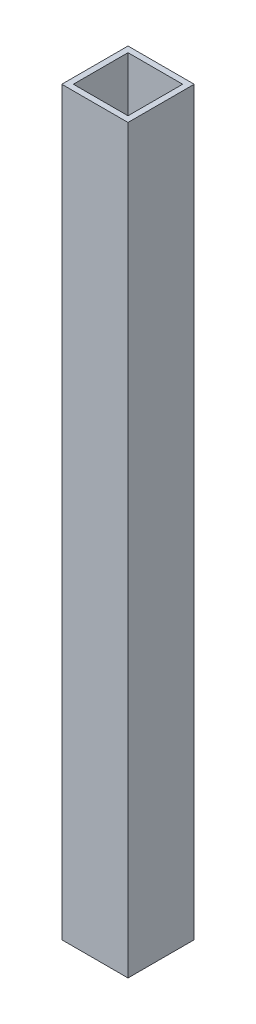
ISO-10303-21;
HEADER;
FILE_DESCRIPTION(('STEP AP214'),'2;1');
FILE_NAME('part.step','',(''),(''),'','','');
FILE_SCHEMA(('AUTOMOTIVE_DESIGN { 1 0 10303 214 1 1 1 1 }'));
ENDSEC;
DATA;
#1=APPLICATION_CONTEXT('core data for automotive mechanical design processes');
#2=APPLICATION_PROTOCOL_DEFINITION('international standard','automotive_design',2000,#1);
#3=PRODUCT_CONTEXT('',#1,'mechanical');
#4=PRODUCT('Part','Part','',(#3));
#5=PRODUCT_RELATED_PRODUCT_CATEGORY('part','',(#4));
#6=PRODUCT_DEFINITION_FORMATION('','',#4);
#7=PRODUCT_DEFINITION_CONTEXT('part definition',#1,'design');
#8=PRODUCT_DEFINITION('design','',#6,#7);
#9=PRODUCT_DEFINITION_SHAPE('','',#8);
#10=(LENGTH_UNIT() NAMED_UNIT(*) SI_UNIT(.MILLI.,.METRE.));
#11=(NAMED_UNIT(*) PLANE_ANGLE_UNIT() SI_UNIT($,.RADIAN.));
#12=(NAMED_UNIT(*) SI_UNIT($,.STERADIAN.) SOLID_ANGLE_UNIT());
#13=UNCERTAINTY_MEASURE_WITH_UNIT(LENGTH_MEASURE(1.E-05),#10,'distance_accuracy_value','');
#14=(GEOMETRIC_REPRESENTATION_CONTEXT(3) GLOBAL_UNCERTAINTY_ASSIGNED_CONTEXT((#13)) GLOBAL_UNIT_ASSIGNED_CONTEXT((#10,
#11,#12)) REPRESENTATION_CONTEXT('',''));
#15=CARTESIAN_POINT('',(0.,0.,0.));
#16=DIRECTION('',(0.,0.,1.));
#17=DIRECTION('',(1.,0.,0.));
#18=AXIS2_PLACEMENT_3D('',#15,#16,#17);
#19=CARTESIAN_POINT('',(0.,211.5,0.));
#20=DIRECTION('',(0.,-1.,0.));
#21=DIRECTION('',(0.,0.,-1.));
#22=AXIS2_PLACEMENT_3D('',#19,#20,#21);
#23=PLANE('',#22);
#24=DIRECTION('',(0.,0.,1.));
#25=VECTOR('',#24,1.);
#26=CARTESIAN_POINT('',(-9.45,211.5,9.45));
#27=LINE('',#26,#25);
#28=CARTESIAN_POINT('',(-9.45,211.5,-9.45));
#29=VERTEX_POINT('',#28);
#30=CARTESIAN_POINT('',(-9.45,211.5,9.45));
#31=VERTEX_POINT('',#30);
#32=EDGE_CURVE('E134',#29,#31,#27,.T.);
#33=ORIENTED_EDGE('',*,*,#32,.T.);
#34=DIRECTION('',(1.,0.,0.));
#35=VECTOR('',#34,1.);
#36=CARTESIAN_POINT('',(-9.45,211.5,9.45));
#37=LINE('',#36,#35);
#38=CARTESIAN_POINT('',(9.45,211.5,9.45));
#39=VERTEX_POINT('',#38);
#40=EDGE_CURVE('E137',#31,#39,#37,.T.);
#41=ORIENTED_EDGE('',*,*,#40,.T.);
#42=DIRECTION('',(0.,0.,-1.));
#43=VECTOR('',#42,1.);
#44=CARTESIAN_POINT('',(9.45,211.5,9.45));
#45=LINE('',#44,#43);
#46=CARTESIAN_POINT('',(9.45,211.5,-9.45));
#47=VERTEX_POINT('',#46);
#48=EDGE_CURVE('E140',#39,#47,#45,.T.);
#49=ORIENTED_EDGE('',*,*,#48,.T.);
#50=DIRECTION('',(-1.,0.,0.));
#51=VECTOR('',#50,1.);
#52=CARTESIAN_POINT('',(-9.45,211.5,-9.45));
#53=LINE('',#52,#51);
#54=EDGE_CURVE('E142',#47,#29,#53,.T.);
#55=ORIENTED_EDGE('',*,*,#54,.T.);
#56=EDGE_LOOP('',(#33,#41,#49,#55));
#57=FACE_BOUND('',#56,.T.);
#58=DIRECTION('',(0.,0.,-1.));
#59=VECTOR('',#58,1.);
#60=CARTESIAN_POINT('',(7.8,211.5,7.8));
#61=LINE('',#60,#59);
#62=CARTESIAN_POINT('',(7.8,211.5,7.8));
#63=VERTEX_POINT('',#62);
#64=CARTESIAN_POINT('',(7.8,211.5,-7.8));
#65=VERTEX_POINT('',#64);
#66=EDGE_CURVE('E98',#63,#65,#61,.T.);
#67=ORIENTED_EDGE('',*,*,#66,.F.);
#68=DIRECTION('',(1.,0.,0.));
#69=VECTOR('',#68,1.);
#70=CARTESIAN_POINT('',(-7.8,211.5,7.8));
#71=LINE('',#70,#69);
#72=CARTESIAN_POINT('',(-7.8,211.5,7.8));
#73=VERTEX_POINT('',#72);
#74=EDGE_CURVE('E120',#73,#63,#71,.T.);
#75=ORIENTED_EDGE('',*,*,#74,.F.);
#76=DIRECTION('',(0.,0.,1.));
#77=VECTOR('',#76,1.);
#78=CARTESIAN_POINT('',(-7.8,211.5,7.8));
#79=LINE('',#78,#77);
#80=CARTESIAN_POINT('',(-7.8,211.5,-7.8));
#81=VERTEX_POINT('',#80);
#82=EDGE_CURVE('E118',#81,#73,#79,.T.);
#83=ORIENTED_EDGE('',*,*,#82,.F.);
#84=DIRECTION('',(-1.,0.,0.));
#85=VECTOR('',#84,1.);
#86=CARTESIAN_POINT('',(-7.8,211.5,-7.8));
#87=LINE('',#86,#85);
#88=EDGE_CURVE('E106',#65,#81,#87,.T.);
#89=ORIENTED_EDGE('',*,*,#88,.F.);
#90=EDGE_LOOP('',(#67,#75,#83,#89));
#91=FACE_BOUND('',#90,.T.);
#92=ADVANCED_FACE('F33',(#57,#91),#23,.F.);
#93=CARTESIAN_POINT('',(0.,0.,0.));
#94=DIRECTION('',(0.,-1.,0.));
#95=DIRECTION('',(0.,0.,-1.));
#96=AXIS2_PLACEMENT_3D('',#93,#94,#95);
#97=PLANE('',#96);
#98=DIRECTION('',(0.,0.,1.));
#99=VECTOR('',#98,1.);
#100=CARTESIAN_POINT('',(-9.45,0.,9.45));
#101=LINE('',#100,#99);
#102=CARTESIAN_POINT('',(-9.45,0.,-9.45));
#103=VERTEX_POINT('',#102);
#104=CARTESIAN_POINT('',(-9.45,0.,9.45));
#105=VERTEX_POINT('',#104);
#106=EDGE_CURVE('E114',#103,#105,#101,.T.);
#107=ORIENTED_EDGE('',*,*,#106,.F.);
#108=DIRECTION('',(-1.,0.,0.));
#109=VECTOR('',#108,1.);
#110=CARTESIAN_POINT('',(-9.45,0.,-9.45));
#111=LINE('',#110,#109);
#112=CARTESIAN_POINT('',(9.45,0.,-9.45));
#113=VERTEX_POINT('',#112);
#114=EDGE_CURVE('E138',#113,#103,#111,.T.);
#115=ORIENTED_EDGE('',*,*,#114,.F.);
#116=DIRECTION('',(0.,0.,-1.));
#117=VECTOR('',#116,1.);
#118=CARTESIAN_POINT('',(9.45,0.,9.45));
#119=LINE('',#118,#117);
#120=CARTESIAN_POINT('',(9.45,0.,9.45));
#121=VERTEX_POINT('',#120);
#122=EDGE_CURVE('E149',#121,#113,#119,.T.);
#123=ORIENTED_EDGE('',*,*,#122,.F.);
#124=DIRECTION('',(1.,0.,0.));
#125=VECTOR('',#124,1.);
#126=CARTESIAN_POINT('',(-9.45,0.,9.45));
#127=LINE('',#126,#125);
#128=EDGE_CURVE('E147',#105,#121,#127,.T.);
#129=ORIENTED_EDGE('',*,*,#128,.F.);
#130=EDGE_LOOP('',(#107,#115,#123,#129));
#131=FACE_BOUND('',#130,.T.);
#132=DIRECTION('',(1.,0.,0.));
#133=VECTOR('',#132,1.);
#134=CARTESIAN_POINT('',(-7.8,0.,7.8));
#135=LINE('',#134,#133);
#136=CARTESIAN_POINT('',(-7.8,0.,7.8));
#137=VERTEX_POINT('',#136);
#138=CARTESIAN_POINT('',(7.8,0.,7.8));
#139=VERTEX_POINT('',#138);
#140=EDGE_CURVE('E107',#137,#139,#135,.T.);
#141=ORIENTED_EDGE('',*,*,#140,.T.);
#142=DIRECTION('',(0.,0.,-1.));
#143=VECTOR('',#142,1.);
#144=CARTESIAN_POINT('',(7.8,0.,7.8));
#145=LINE('',#144,#143);
#146=CARTESIAN_POINT('',(7.8,0.,-7.8));
#147=VERTEX_POINT('',#146);
#148=EDGE_CURVE('E56',#139,#147,#145,.T.);
#149=ORIENTED_EDGE('',*,*,#148,.T.);
#150=DIRECTION('',(-1.,0.,0.));
#151=VECTOR('',#150,1.);
#152=CARTESIAN_POINT('',(-7.8,0.,-7.8));
#153=LINE('',#152,#151);
#154=CARTESIAN_POINT('',(-7.8,0.,-7.8));
#155=VERTEX_POINT('',#154);
#156=EDGE_CURVE('E113',#147,#155,#153,.T.);
#157=ORIENTED_EDGE('',*,*,#156,.T.);
#158=DIRECTION('',(0.,0.,1.));
#159=VECTOR('',#158,1.);
#160=CARTESIAN_POINT('',(-7.8,0.,7.8));
#161=LINE('',#160,#159);
#162=EDGE_CURVE('E126',#155,#137,#161,.T.);
#163=ORIENTED_EDGE('',*,*,#162,.T.);
#164=EDGE_LOOP('',(#141,#149,#157,#163));
#165=FACE_BOUND('',#164,.T.);
#166=ADVANCED_FACE('F167',(#131,#165),#97,.T.);
#167=CARTESIAN_POINT('',(-9.45,211.5,9.45));
#168=DIRECTION('',(1.,0.,0.));
#169=DIRECTION('',(0.,0.,-1.));
#170=AXIS2_PLACEMENT_3D('',#167,#168,#169);
#171=PLANE('',#170);
#172=ORIENTED_EDGE('',*,*,#106,.T.);
#173=DIRECTION('',(0.,-1.,0.));
#174=VECTOR('',#173,1.);
#175=CARTESIAN_POINT('',(-9.45,211.5,9.45));
#176=LINE('',#175,#174);
#177=EDGE_CURVE('E11',#31,#105,#176,.T.);
#178=ORIENTED_EDGE('',*,*,#177,.F.);
#179=ORIENTED_EDGE('',*,*,#32,.F.);
#180=DIRECTION('',(0.,-1.,0.));
#181=VECTOR('',#180,1.);
#182=CARTESIAN_POINT('',(-9.45,211.5,-9.45));
#183=LINE('',#182,#181);
#184=EDGE_CURVE('E144',#29,#103,#183,.T.);
#185=ORIENTED_EDGE('',*,*,#184,.T.);
#186=EDGE_LOOP('',(#172,#178,#179,#185));
#187=FACE_BOUND('',#186,.T.);
#188=ADVANCED_FACE('F35',(#187),#171,.F.);
#189=CARTESIAN_POINT('',(-9.45,211.5,9.45));
#190=DIRECTION('',(0.,0.,-1.));
#191=DIRECTION('',(-1.,0.,0.));
#192=AXIS2_PLACEMENT_3D('',#189,#190,#191);
#193=PLANE('',#192);
#194=ORIENTED_EDGE('',*,*,#128,.T.);
#195=DIRECTION('',(0.,-1.,0.));
#196=VECTOR('',#195,1.);
#197=CARTESIAN_POINT('',(9.45,211.5,9.45));
#198=LINE('',#197,#196);
#199=EDGE_CURVE('E41',#39,#121,#198,.T.);
#200=ORIENTED_EDGE('',*,*,#199,.F.);
#201=ORIENTED_EDGE('',*,*,#40,.F.);
#202=ORIENTED_EDGE('',*,*,#177,.T.);
#203=EDGE_LOOP('',(#194,#200,#201,#202));
#204=FACE_BOUND('',#203,.T.);
#205=ADVANCED_FACE('F177',(#204),#193,.F.);
#206=CARTESIAN_POINT('',(9.45,211.5,9.45));
#207=DIRECTION('',(-1.,0.,0.));
#208=DIRECTION('',(0.,0.,1.));
#209=AXIS2_PLACEMENT_3D('',#206,#207,#208);
#210=PLANE('',#209);
#211=ORIENTED_EDGE('',*,*,#122,.T.);
#212=DIRECTION('',(0.,-1.,0.));
#213=VECTOR('',#212,1.);
#214=CARTESIAN_POINT('',(9.45,211.5,-9.45));
#215=LINE('',#214,#213);
#216=EDGE_CURVE('E154',#47,#113,#215,.T.);
#217=ORIENTED_EDGE('',*,*,#216,.F.);
#218=ORIENTED_EDGE('',*,*,#48,.F.);
#219=ORIENTED_EDGE('',*,*,#199,.T.);
#220=EDGE_LOOP('',(#211,#217,#218,#219));
#221=FACE_BOUND('',#220,.T.);
#222=ADVANCED_FACE('F161',(#221),#210,.F.);
#223=CARTESIAN_POINT('',(-9.45,211.5,-9.45));
#224=DIRECTION('',(0.,0.,1.));
#225=DIRECTION('',(1.,0.,0.));
#226=AXIS2_PLACEMENT_3D('',#223,#224,#225);
#227=PLANE('',#226);
#228=ORIENTED_EDGE('',*,*,#114,.T.);
#229=ORIENTED_EDGE('',*,*,#184,.F.);
#230=ORIENTED_EDGE('',*,*,#54,.F.);
#231=ORIENTED_EDGE('',*,*,#216,.T.);
#232=EDGE_LOOP('',(#228,#229,#230,#231));
#233=FACE_BOUND('',#232,.T.);
#234=ADVANCED_FACE('F171',(#233),#227,.F.);
#235=CARTESIAN_POINT('',(7.8,211.5,7.8));
#236=DIRECTION('',(-1.,0.,0.));
#237=DIRECTION('',(0.,0.,1.));
#238=AXIS2_PLACEMENT_3D('',#235,#236,#237);
#239=PLANE('',#238);
#240=ORIENTED_EDGE('',*,*,#148,.F.);
#241=DIRECTION('',(0.,-1.,0.));
#242=VECTOR('',#241,1.);
#243=CARTESIAN_POINT('',(7.8,211.5,7.8));
#244=LINE('',#243,#242);
#245=EDGE_CURVE('E102',#63,#139,#244,.T.);
#246=ORIENTED_EDGE('',*,*,#245,.F.);
#247=ORIENTED_EDGE('',*,*,#66,.T.);
#248=DIRECTION('',(0.,-1.,0.));
#249=VECTOR('',#248,1.);
#250=CARTESIAN_POINT('',(7.8,211.5,-7.8));
#251=LINE('',#250,#249);
#252=EDGE_CURVE('E101',#65,#147,#251,.T.);
#253=ORIENTED_EDGE('',*,*,#252,.T.);
#254=EDGE_LOOP('',(#240,#246,#247,#253));
#255=FACE_BOUND('',#254,.T.);
#256=ADVANCED_FACE('F100',(#255),#239,.T.);
#257=CARTESIAN_POINT('',(-7.8,211.5,-7.8));
#258=DIRECTION('',(0.,0.,1.));
#259=DIRECTION('',(1.,0.,0.));
#260=AXIS2_PLACEMENT_3D('',#257,#258,#259);
#261=PLANE('',#260);
#262=ORIENTED_EDGE('',*,*,#156,.F.);
#263=ORIENTED_EDGE('',*,*,#252,.F.);
#264=ORIENTED_EDGE('',*,*,#88,.T.);
#265=DIRECTION('',(0.,-1.,0.));
#266=VECTOR('',#265,1.);
#267=CARTESIAN_POINT('',(-7.8,211.5,-7.8));
#268=LINE('',#267,#266);
#269=EDGE_CURVE('E115',#81,#155,#268,.T.);
#270=ORIENTED_EDGE('',*,*,#269,.T.);
#271=EDGE_LOOP('',(#262,#263,#264,#270));
#272=FACE_BOUND('',#271,.T.);
#273=ADVANCED_FACE('F110',(#272),#261,.T.);
#274=CARTESIAN_POINT('',(-7.8,211.5,7.8));
#275=DIRECTION('',(1.,0.,0.));
#276=DIRECTION('',(0.,0.,-1.));
#277=AXIS2_PLACEMENT_3D('',#274,#275,#276);
#278=PLANE('',#277);
#279=ORIENTED_EDGE('',*,*,#162,.F.);
#280=ORIENTED_EDGE('',*,*,#269,.F.);
#281=ORIENTED_EDGE('',*,*,#82,.T.);
#282=DIRECTION('',(0.,-1.,0.));
#283=VECTOR('',#282,1.);
#284=CARTESIAN_POINT('',(-7.8,211.5,7.8));
#285=LINE('',#284,#283);
#286=EDGE_CURVE('E48',#73,#137,#285,.T.);
#287=ORIENTED_EDGE('',*,*,#286,.T.);
#288=EDGE_LOOP('',(#279,#280,#281,#287));
#289=FACE_BOUND('',#288,.T.);
#290=ADVANCED_FACE('F200',(#289),#278,.T.);
#291=CARTESIAN_POINT('',(-7.8,211.5,7.8));
#292=DIRECTION('',(0.,0.,-1.));
#293=DIRECTION('',(-1.,0.,0.));
#294=AXIS2_PLACEMENT_3D('',#291,#292,#293);
#295=PLANE('',#294);
#296=ORIENTED_EDGE('',*,*,#140,.F.);
#297=ORIENTED_EDGE('',*,*,#286,.F.);
#298=ORIENTED_EDGE('',*,*,#74,.T.);
#299=ORIENTED_EDGE('',*,*,#245,.T.);
#300=EDGE_LOOP('',(#296,#297,#298,#299));
#301=FACE_BOUND('',#300,.T.);
#302=ADVANCED_FACE('F204',(#301),#295,.T.);
#303=CLOSED_SHELL('',(#92,#166,#188,#205,#222,#234,#256,#273,#290,#302));
#304=MANIFOLD_SOLID_BREP('B2',#303);
#305=ADVANCED_BREP_SHAPE_REPRESENTATION('',(#18,#304),#14);
#306=SHAPE_DEFINITION_REPRESENTATION(#9,#305);
ENDSEC;
END-ISO-10303-21;
